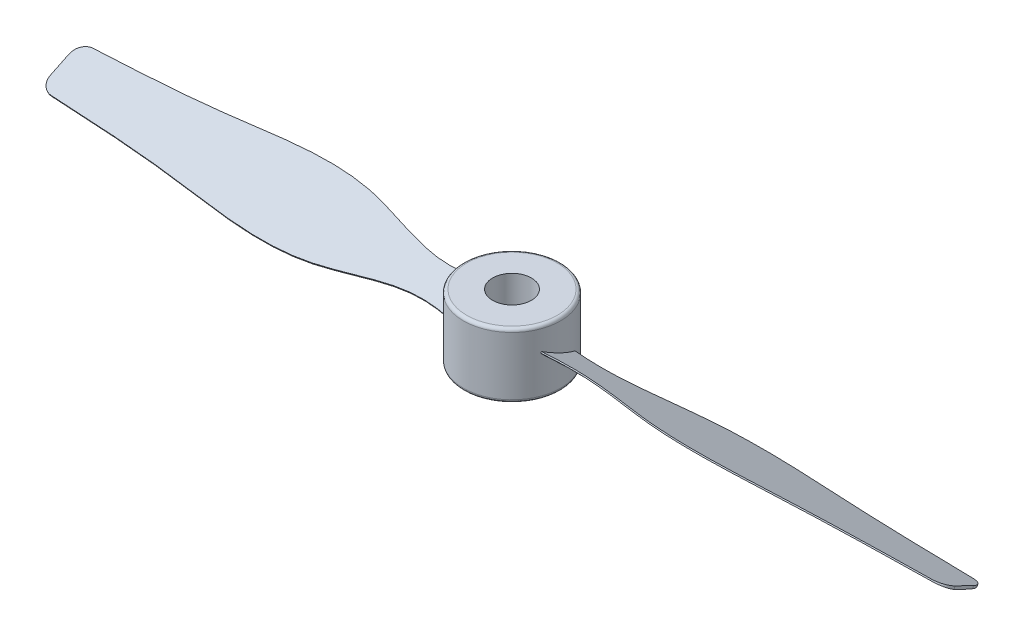
ISO-10303-21;
HEADER;
FILE_DESCRIPTION(('STEP AP214'),'2;1');
FILE_NAME('part.step','',(''),(''),'','','');
FILE_SCHEMA(('AUTOMOTIVE_DESIGN { 1 0 10303 214 1 1 1 1 }'));
ENDSEC;
DATA;
#1=APPLICATION_CONTEXT('core data for automotive mechanical design processes');
#2=APPLICATION_PROTOCOL_DEFINITION('international standard','automotive_design',2000,#1);
#3=PRODUCT_CONTEXT('',#1,'mechanical');
#4=PRODUCT('Part','Part','',(#3));
#5=PRODUCT_RELATED_PRODUCT_CATEGORY('part','',(#4));
#6=PRODUCT_DEFINITION_FORMATION('','',#4);
#7=PRODUCT_DEFINITION_CONTEXT('part definition',#1,'design');
#8=PRODUCT_DEFINITION('design','',#6,#7);
#9=PRODUCT_DEFINITION_SHAPE('','',#8);
#10=(LENGTH_UNIT() NAMED_UNIT(*) SI_UNIT(.MILLI.,.METRE.));
#11=(NAMED_UNIT(*) PLANE_ANGLE_UNIT() SI_UNIT($,.RADIAN.));
#12=(NAMED_UNIT(*) SI_UNIT($,.STERADIAN.) SOLID_ANGLE_UNIT());
#13=UNCERTAINTY_MEASURE_WITH_UNIT(LENGTH_MEASURE(1.E-05),#10,'distance_accuracy_value','');
#14=(GEOMETRIC_REPRESENTATION_CONTEXT(3) GLOBAL_UNCERTAINTY_ASSIGNED_CONTEXT((#13)) GLOBAL_UNIT_ASSIGNED_CONTEXT((#10,
#11,#12)) REPRESENTATION_CONTEXT('',''));
#15=CARTESIAN_POINT('',(0.,0.,0.));
#16=DIRECTION('',(0.,0.,1.));
#17=DIRECTION('',(1.,0.,0.));
#18=AXIS2_PLACEMENT_3D('',#15,#16,#17);
#19=CARTESIAN_POINT('',(0.,10.,0.));
#20=DIRECTION('',(0.,-1.,0.));
#21=DIRECTION('',(0.,0.,-1.));
#22=AXIS2_PLACEMENT_3D('',#19,#20,#21);
#23=CYLINDRICAL_SURFACE('',#22,7.5);
#24=CARTESIAN_POINT('',(0.,0.5,0.));
#25=DIRECTION('',(0.,1.,0.));
#26=DIRECTION('',(0.,0.,1.));
#27=AXIS2_PLACEMENT_3D('',#24,#25,#26);
#28=CIRCLE('',#27,7.5);
#29=CARTESIAN_POINT('',(0.,0.5,7.5));
#30=VERTEX_POINT('',#29);
#31=EDGE_CURVE('E450',#30,#30,#28,.T.);
#32=ORIENTED_EDGE('',*,*,#31,.T.);
#33=EDGE_LOOP('',(#32));
#34=FACE_BOUND('',#33,.T.);
#35=CARTESIAN_POINT('',(0.,9.5,0.));
#36=DIRECTION('',(0.,1.,0.));
#37=DIRECTION('',(0.,0.,1.));
#38=AXIS2_PLACEMENT_3D('',#35,#36,#37);
#39=CIRCLE('',#38,7.5);
#40=CARTESIAN_POINT('',(0.,9.5,7.5));
#41=VERTEX_POINT('',#40);
#42=EDGE_CURVE('E452',#41,#41,#39,.F.);
#43=ORIENTED_EDGE('',*,*,#42,.T.);
#44=EDGE_LOOP('',(#43));
#45=FACE_BOUND('',#44,.T.);
#46=CARTESIAN_POINT('',(7.06979787903294,6.43030076067993,2.50358901372038));
#47=CARTESIAN_POINT('',(7.06437746178913,6.40065388167233,2.5188965163108));
#48=CARTESIAN_POINT('',(7.05889862031606,6.3710207854884,2.53420954992158));
#49=CARTESIAN_POINT('',(7.04782408891142,6.31178215876791,2.56484667918385));
#50=CARTESIAN_POINT('',(7.04222839897984,6.28217662823135,2.58017077483534));
#51=CARTESIAN_POINT('',(7.036574284819,6.25258488051848,2.59550040150718));
#52=B_SPLINE_CURVE_WITH_KNOTS('',3,(#46,#47,#48,#49,#50,#51),.UNSPECIFIED.,.F.,.F.,(4,2,4),(0.,
0.101408302546085,0.202816605092171),.UNSPECIFIED.);
#53=CARTESIAN_POINT('',(7.06979787903294,6.43030076067993,2.50358901372038));
#54=VERTEX_POINT('',#53);
#55=CARTESIAN_POINT('',(7.03657428482255,6.2525848805371,2.59550040149754));
#56=VERTEX_POINT('',#55);
#57=EDGE_CURVE('E367',#54,#56,#52,.T.);
#58=ORIENTED_EDGE('',*,*,#57,.F.);
#59=CARTESIAN_POINT('',(0.,5.22207218793321,0.));
#60=DIRECTION('',(0.,-0.900608049397676,0.434632190892613));
#61=DIRECTION('',(0.,-0.434632190892614,-0.900608049397676));
#62=AXIS2_PLACEMENT_3D('',#59,#60,#61);
#63=ELLIPSE('',#62,8.32770704749528,7.5);
#64=CARTESIAN_POINT('',(7.49987406218174,5.20109689924882,-0.0434632183796787));
#65=VERTEX_POINT('',#64);
#66=EDGE_CURVE('E391',#65,#54,#63,.T.);
#67=ORIENTED_EDGE('',*,*,#66,.F.);
#68=CARTESIAN_POINT('',(7.49987406218174,5.02097528902684,0.0434632190892608));
#69=DIRECTION('',(0.,0.900608049397676,-0.434632190892614));
#70=VECTOR('',#69,1.);
#71=LINE('',#68,#70);
#72=CARTESIAN_POINT('',(7.49987406218174,5.02097528902684,0.0434632190892648));
#73=VERTEX_POINT('',#72);
#74=EDGE_CURVE('E601',#65,#73,#71,.F.);
#75=ORIENTED_EDGE('',*,*,#74,.T.);
#76=CARTESIAN_POINT('',(0.,5.,0.));
#77=DIRECTION('',(0.,-0.900608049397676,0.434632190892614));
#78=DIRECTION('',(0.,-0.434632190892614,-0.900608049397676));
#79=AXIS2_PLACEMENT_3D('',#76,#77,#78);
#80=ELLIPSE('',#79,8.32770704749528,7.5);
#81=CARTESIAN_POINT('',(7.03657428482256,3.74741511946291,-2.59550040149754));
#82=VERTEX_POINT('',#81);
#83=EDGE_CURVE('E552',#82,#73,#80,.T.);
#84=ORIENTED_EDGE('',*,*,#83,.F.);
#85=CARTESIAN_POINT('',(7.03657428482256,3.74741511946291,-2.59550040149754));
#86=CARTESIAN_POINT('',(7.07662905876549,3.76093746206632,-2.48693024530718));
#87=CARTESIAN_POINT('',(7.11408835111391,3.77621928159622,-2.37761597142014));
#88=CARTESIAN_POINT('',(7.1837788845091,3.81051952778591,-2.15790963326682));
#89=CARTESIAN_POINT('',(7.21600997018926,3.82953806545262,-2.04751753707421));
#90=CARTESIAN_POINT('',(7.27520399301563,3.87152818053347,-1.82607483594392));
#91=CARTESIAN_POINT('',(7.30216704128785,3.8944996745432,-1.71502424494771));
#92=CARTESIAN_POINT('',(7.35074091172692,3.94442048993412,-1.4931354672337));
#93=CARTESIAN_POINT('',(7.37237271355903,3.97135353070412,-1.38229820799379));
#94=CARTESIAN_POINT('',(7.4104734953373,4.02935041300608,-1.16082152262844));
#95=CARTESIAN_POINT('',(7.42694274541108,4.06041403828637,-1.05018208645332));
#96=CARTESIAN_POINT('',(7.45481357318441,4.12672654089465,-0.829533017913956));
#97=CARTESIAN_POINT('',(7.46621533304317,4.16197526772461,-0.719523363051548));
#98=CARTESIAN_POINT('',(7.48850992868821,4.25522083005756,-0.446297107920718));
#99=CARTESIAN_POINT('',(7.49635475476582,4.31583871223352,-0.283709407251972));
#100=CARTESIAN_POINT('',(7.50162842243936,4.44666749347483,0.0377406690701018));
#101=CARTESIAN_POINT('',(7.49905572178172,4.51687981145319,0.196602489627101));
#102=CARTESIAN_POINT('',(7.48432471955586,4.66703354794572,0.509308662821247));
#103=CARTESIAN_POINT('',(7.47216116663627,4.74698027613094,0.663150218604599));
#104=CARTESIAN_POINT('',(7.43928098302997,4.91660507625531,0.964391798605734));
#105=CARTESIAN_POINT('',(7.41856563990044,5.00628168176684,1.11179278882196));
#106=CARTESIAN_POINT('',(7.37302153390867,5.18283840081659,1.38005664239164));
#107=CARTESIAN_POINT('',(7.34909386344946,5.26853127339078,1.50185785930604));
#108=CARTESIAN_POINT('',(7.29659982675239,5.44704323813361,1.73907662518342));
#109=CARTESIAN_POINT('',(7.26803336584932,5.53986247571175,1.85449404380584));
#110=CARTESIAN_POINT('',(7.20720248124752,5.73231337014974,2.07838622001872));
#111=CARTESIAN_POINT('',(7.17493926726574,5.83194279417873,2.18686323076655));
#112=CARTESIAN_POINT('',(7.1076228475285,6.03758378786646,2.39663100761143));
#113=CARTESIAN_POINT('',(7.07257015549429,6.14359418150866,2.49792309044413));
#114=CARTESIAN_POINT('',(7.03657428482257,6.2525848805371,2.59550040149754));
#115=B_SPLINE_CURVE_WITH_KNOTS('',3,(#85,#86,#87,#88,#89,#90,#91,#92,#93,#94,#95,#96,#97,#98,
#99,#100,#101,#102,#103,#104,#105,#106,#107,#108,#109,#110,#111,#112,#113,#114),.UNSPECIFIED.,
.F.,.F.,(4,2,2,2,2,2,2,2,2,2,2,2,2,2,4),(0.,0.349495551491645,0.6990014870402,1.04850004918046,
1.39660046944836,1.74468267251622,2.0927523621889,2.61318664277018,3.13369797340283,
3.65449450158715,4.175212647248,4.62734951014627,5.07949560109898,5.53149415311062,
5.98340965507997),.UNSPECIFIED.);
#116=EDGE_CURVE('E356',#82,#56,#115,.T.);
#117=ORIENTED_EDGE('',*,*,#116,.T.);
#118=EDGE_LOOP('',(#58,#67,#75,#84,#117));
#119=FACE_BOUND('',#118,.T.);
#120=CARTESIAN_POINT('',(-7.06979787903294,6.43030076067993,-2.50358901372038));
#121=CARTESIAN_POINT('',(-7.06437746178913,6.40065388167233,-2.5188965163108));
#122=CARTESIAN_POINT('',(-7.05889862031606,6.3710207854884,-2.53420954992158));
#123=CARTESIAN_POINT('',(-7.04782408891142,6.31178215876791,-2.56484667918385));
#124=CARTESIAN_POINT('',(-7.04222839897984,6.28217662823135,-2.58017077483534));
#125=CARTESIAN_POINT('',(-7.036574284819,6.25258488051848,-2.59550040150718));
#126=B_SPLINE_CURVE_WITH_KNOTS('',3,(#120,#121,#122,#123,#124,#125),.UNSPECIFIED.,.F.,.F.,(4,2,
4),(0.,0.101408302546085,0.202816605092171),.UNSPECIFIED.);
#127=CARTESIAN_POINT('',(-7.06979787903294,6.43030076067993,-2.50358901372038));
#128=VERTEX_POINT('',#127);
#129=CARTESIAN_POINT('',(-7.03657428482255,6.2525848805371,-2.59550040149754));
#130=VERTEX_POINT('',#129);
#131=EDGE_CURVE('E302',#128,#130,#126,.T.);
#132=ORIENTED_EDGE('',*,*,#131,.F.);
#133=CARTESIAN_POINT('',(0.,5.22207218793321,0.));
#134=DIRECTION('',(0.,-0.900608049397676,-0.434632190892613));
#135=DIRECTION('',(0.,-0.434632190892614,0.900608049397676));
#136=AXIS2_PLACEMENT_3D('',#133,#134,#135);
#137=ELLIPSE('',#136,8.32770704749528,7.5);
#138=CARTESIAN_POINT('',(-7.49987406218174,5.20109689924882,0.0434632183796787));
#139=VERTEX_POINT('',#138);
#140=EDGE_CURVE('E390',#139,#128,#137,.T.);
#141=ORIENTED_EDGE('',*,*,#140,.F.);
#142=CARTESIAN_POINT('',(-7.49987406218174,5.20109689890637,0.0434632190892623));
#143=CARTESIAN_POINT('',(-7.49994528928224,5.14422940763765,0.03117240682583));
#144=CARTESIAN_POINT('',(-7.49998630325902,5.08736190459017,0.0188815920130506));
#145=CARTESIAN_POINT('',(-7.49999903471289,5.02032959355229,0.00439384984873389));
#146=CARTESIAN_POINT('',(-7.50000000000886,5.01016479696431,0.0021969249650925));
#147=CARTESIAN_POINT('',(-7.5,5.,0.));
#148=B_SPLINE_CURVE_WITH_KNOTS('',3,(#142,#143,#144,#145,#146,#147),.UNSPECIFIED.,.F.,.F.,(4,2,
4),(0.,0.174541709696757,0.205740205268831),.UNSPECIFIED.);
#149=CARTESIAN_POINT('',(-7.5,5.,0.));
#150=VERTEX_POINT('',#149);
#151=EDGE_CURVE('E306',#150,#139,#148,.F.);
#152=ORIENTED_EDGE('',*,*,#151,.F.);
#153=CARTESIAN_POINT('',(0.,5.,0.));
#154=DIRECTION('',(0.,-0.900608049397676,-0.434632190892614));
#155=DIRECTION('',(0.,-0.434632190892614,0.900608049397676));
#156=AXIS2_PLACEMENT_3D('',#153,#154,#155);
#157=ELLIPSE('',#156,8.32770704749528,7.5);
#158=CARTESIAN_POINT('',(-7.03657428482256,3.74741511946291,2.59550040149754));
#159=VERTEX_POINT('',#158);
#160=EDGE_CURVE('E315',#159,#150,#157,.T.);
#161=ORIENTED_EDGE('',*,*,#160,.F.);
#162=CARTESIAN_POINT('',(-7.03657428482256,3.74741511946291,2.59550040149754));
#163=CARTESIAN_POINT('',(-7.07662905876549,3.76093746206632,2.48693024530718));
#164=CARTESIAN_POINT('',(-7.11408835111391,3.77621928159622,2.37761597142014));
#165=CARTESIAN_POINT('',(-7.1837788845091,3.81051952778591,2.15790963326682));
#166=CARTESIAN_POINT('',(-7.21600997018926,3.82953806545262,2.04751753707421));
#167=CARTESIAN_POINT('',(-7.27520399301563,3.87152818053347,1.82607483594392));
#168=CARTESIAN_POINT('',(-7.30216704128785,3.8944996745432,1.71502424494771));
#169=CARTESIAN_POINT('',(-7.35074091172692,3.94442048993412,1.4931354672337));
#170=CARTESIAN_POINT('',(-7.37237271355903,3.97135353070412,1.38229820799379));
#171=CARTESIAN_POINT('',(-7.4104734953373,4.02935041300608,1.16082152262844));
#172=CARTESIAN_POINT('',(-7.42694274541108,4.06041403828637,1.05018208645332));
#173=CARTESIAN_POINT('',(-7.45481357318441,4.12672654089465,0.829533017913956));
#174=CARTESIAN_POINT('',(-7.46621533304317,4.16197526772461,0.719523363051548));
#175=CARTESIAN_POINT('',(-7.48850992868821,4.25522083005756,0.446297107920718));
#176=CARTESIAN_POINT('',(-7.49635475476582,4.31583871223352,0.283709407251972));
#177=CARTESIAN_POINT('',(-7.50162842243936,4.44666749347483,-0.0377406690701018));
#178=CARTESIAN_POINT('',(-7.49905572178172,4.51687981145319,-0.196602489627101));
#179=CARTESIAN_POINT('',(-7.48432471955586,4.66703354794572,-0.509308662821247));
#180=CARTESIAN_POINT('',(-7.47216116663627,4.74698027613094,-0.663150218604599));
#181=CARTESIAN_POINT('',(-7.43928098302997,4.91660507625531,-0.964391798605734));
#182=CARTESIAN_POINT('',(-7.41856563990044,5.00628168176684,-1.11179278882196));
#183=CARTESIAN_POINT('',(-7.37302153390867,5.18283840081659,-1.38005664239164));
#184=CARTESIAN_POINT('',(-7.34909386344946,5.26853127339078,-1.50185785930604));
#185=CARTESIAN_POINT('',(-7.29659982675239,5.44704323813361,-1.73907662518342));
#186=CARTESIAN_POINT('',(-7.26803336584932,5.53986247571175,-1.85449404380584));
#187=CARTESIAN_POINT('',(-7.20720248124752,5.73231337014974,-2.07838622001872));
#188=CARTESIAN_POINT('',(-7.17493926726574,5.83194279417873,-2.18686323076655));
#189=CARTESIAN_POINT('',(-7.1076228475285,6.03758378786646,-2.39663100761143));
#190=CARTESIAN_POINT('',(-7.07257015549429,6.14359418150866,-2.49792309044413));
#191=CARTESIAN_POINT('',(-7.03657428482257,6.2525848805371,-2.59550040149754));
#192=B_SPLINE_CURVE_WITH_KNOTS('',3,(#162,#163,#164,#165,#166,#167,#168,#169,#170,#171,#172,
#173,#174,#175,#176,#177,#178,#179,#180,#181,#182,#183,#184,#185,#186,#187,#188,#189,#190,#191),
.UNSPECIFIED.,.F.,.F.,(4,2,2,2,2,2,2,2,2,2,2,2,2,2,4),(0.,0.349495551491645,0.6990014870402,
1.04850004918046,1.39660046944836,1.74468267251622,2.0927523621889,2.61318664277018,
3.13369797340283,3.65449450158715,4.175212647248,4.62734951014627,5.07949560109898,
5.53149415311062,5.98340965507997),.UNSPECIFIED.);
#193=EDGE_CURVE('E381',#159,#130,#192,.T.);
#194=ORIENTED_EDGE('',*,*,#193,.T.);
#195=EDGE_LOOP('',(#132,#141,#152,#161,#194));
#196=FACE_BOUND('',#195,.T.);
#197=ADVANCED_FACE('F171',(#34,#45,#119,#196),#23,.T.);
#198=CARTESIAN_POINT('',(0.,10.,0.));
#199=DIRECTION('',(0.,1.,0.));
#200=DIRECTION('',(0.,0.,1.));
#201=AXIS2_PLACEMENT_3D('',#198,#199,#200);
#202=PLANE('',#201);
#203=CARTESIAN_POINT('',(0.,10.,0.));
#204=DIRECTION('',(0.,1.,0.));
#205=DIRECTION('',(0.,0.,1.));
#206=AXIS2_PLACEMENT_3D('',#203,#204,#205);
#207=CIRCLE('',#206,7.);
#208=CARTESIAN_POINT('',(0.,10.,7.));
#209=VERTEX_POINT('',#208);
#210=EDGE_CURVE('E12',#209,#209,#207,.T.);
#211=ORIENTED_EDGE('',*,*,#210,.T.);
#212=EDGE_LOOP('',(#211));
#213=FACE_BOUND('',#212,.T.);
#214=CARTESIAN_POINT('',(0.,10.,0.));
#215=DIRECTION('',(0.,1.,0.));
#216=DIRECTION('',(0.,0.,1.));
#217=AXIS2_PLACEMENT_3D('',#214,#215,#216);
#218=CIRCLE('',#217,3.);
#219=CARTESIAN_POINT('',(0.,10.,3.));
#220=VERTEX_POINT('',#219);
#221=EDGE_CURVE('E660',#220,#220,#218,.T.);
#222=ORIENTED_EDGE('',*,*,#221,.F.);
#223=EDGE_LOOP('',(#222));
#224=FACE_BOUND('',#223,.T.);
#225=ADVANCED_FACE('F346',(#213,#224),#202,.T.);
#226=CARTESIAN_POINT('',(0.,0.,0.));
#227=DIRECTION('',(0.,1.,0.));
#228=DIRECTION('',(0.,0.,1.));
#229=AXIS2_PLACEMENT_3D('',#226,#227,#228);
#230=PLANE('',#229);
#231=CARTESIAN_POINT('',(0.,0.,0.));
#232=DIRECTION('',(0.,1.,0.));
#233=DIRECTION('',(0.,0.,1.));
#234=AXIS2_PLACEMENT_3D('',#231,#232,#233);
#235=CIRCLE('',#234,7.);
#236=CARTESIAN_POINT('',(0.,0.,7.));
#237=VERTEX_POINT('',#236);
#238=EDGE_CURVE('E180',#237,#237,#235,.F.);
#239=ORIENTED_EDGE('',*,*,#238,.T.);
#240=EDGE_LOOP('',(#239));
#241=FACE_BOUND('',#240,.T.);
#242=CARTESIAN_POINT('',(0.,0.,0.));
#243=DIRECTION('',(0.,1.,0.));
#244=DIRECTION('',(0.,0.,1.));
#245=AXIS2_PLACEMENT_3D('',#242,#243,#244);
#246=CIRCLE('',#245,3.);
#247=CARTESIAN_POINT('',(0.,0.,3.));
#248=VERTEX_POINT('',#247);
#249=EDGE_CURVE('E667',#248,#248,#246,.T.);
#250=ORIENTED_EDGE('',*,*,#249,.T.);
#251=EDGE_LOOP('',(#250));
#252=FACE_BOUND('',#251,.T.);
#253=ADVANCED_FACE('F348',(#241,#252),#230,.F.);
#254=CARTESIAN_POINT('',(69.8,3.47878733187585,-3.15212817289187));
#255=CARTESIAN_POINT('',(62.5395563128578,3.35928622722067,-3.39974825032641));
#256=CARTESIAN_POINT('',(47.955671430176,3.11924712923402,-3.89713695817375));
#257=CARTESIAN_POINT('',(28.9148169987277,1.83903246168579,-6.54988946641071));
#258=CARTESIAN_POINT('',(13.0312032489261,4.52447028863247,-0.985352430766383));
#259=CARTESIAN_POINT('',(4.33886564646154,3.53704044231573,-3.0314210065477));
#260=CARTESIAN_POINT('',(0.,3.04415514098324,-4.05273622228954));
#261=CARTESIAN_POINT('',(69.8,4.04397010830119,-1.38852954050064));
#262=CARTESIAN_POINT('',(62.5395563128578,3.93607568500504,-1.34620821791078));
#263=CARTESIAN_POINT('',(47.955671430176,3.71935065873412,-1.26119835855104));
#264=CARTESIAN_POINT('',(28.9148169987277,2.46597699231558,-3.10309342658199));
#265=CARTESIAN_POINT('',(13.0312032489261,4.36092874798643,-0.684881670681051));
#266=CARTESIAN_POINT('',(4.33886564646154,3.80582267312915,-1.006343469233));
#267=CARTESIAN_POINT('',(0.,3.52873602641889,-1.16680428175267));
#268=CARTESIAN_POINT('',(69.8,5.22807759822828,1.40481135694913));
#269=CARTESIAN_POINT('',(62.5395563128578,5.02578705316163,1.40217643648697));
#270=CARTESIAN_POINT('',(47.955671430176,4.61945072590224,1.39688373285189));
#271=CARTESIAN_POINT('',(28.9148169987277,5.65791825656368,3.71565990737908));
#272=CARTESIAN_POINT('',(13.0312032489261,4.78912877354933,0.873765705755611));
#273=CARTESIAN_POINT('',(4.33886564646154,4.55350358863067,1.22992495080293));
#274=CARTESIAN_POINT('',(0.,4.43588896445928,1.40770533436365));
#275=CARTESIAN_POINT('',(69.8,6.52121266812416,3.15212817289188));
#276=CARTESIAN_POINT('',(62.5395563128578,6.64071377277934,3.39974825032641));
#277=CARTESIAN_POINT('',(47.955671430176,6.88075287076599,3.89713695817375));
#278=CARTESIAN_POINT('',(28.9148169987277,8.16096753831422,6.54988946641071));
#279=CARTESIAN_POINT('',(13.0312032489261,5.47552971136754,0.985352430766382));
#280=CARTESIAN_POINT('',(4.33886564646154,6.46295955768428,3.0314210065477));
#281=CARTESIAN_POINT('',(0.,6.95584485901677,4.05273622228954));
#282=B_SPLINE_SURFACE_WITH_KNOTS('',3,3,((#254,#255,#256,#257,#258,#259,#260),(#261,#262,#263,
#264,#265,#266,#267),(#268,#269,#270,#271,#272,#273,#274),(#275,#276,#277,#278,#279,#280,#281)),
.UNSPECIFIED.,.F.,.F.,.F.,(4,4),(4,1,1,1,4),(0.,1.),(0.,0.311774030948101,0.626253266698981,
0.813440649022051,1.),.UNSPECIFIED.);
#283=CARTESIAN_POINT('',(69.8,3.47878733187585,-3.15212817289187));
#284=CARTESIAN_POINT('',(62.5395563128578,3.35928622722067,-3.3997482503264));
#285=CARTESIAN_POINT('',(47.955671430176,3.11924712923402,-3.89713695817374));
#286=CARTESIAN_POINT('',(28.9148169987277,1.83903246168579,-6.54988946641071));
#287=CARTESIAN_POINT('',(13.0312032489261,4.52447028863247,-0.985352430766383));
#288=CARTESIAN_POINT('',(4.33886564646154,3.53704044231573,-3.0314210065477));
#289=CARTESIAN_POINT('',(0.,3.04415514098324,-4.05273622228954));
#290=B_SPLINE_CURVE_WITH_KNOTS('',3,(#283,#284,#285,#286,#287,#288,#289),.UNSPECIFIED.,.F.,.F.,
(4,1,1,1,4),(0.,0.311774030948101,0.626253266698981,0.813440649022051,1.),.UNSPECIFIED.);
#291=CARTESIAN_POINT('',(67.8765939984037,3.44700257720184,-3.21798985204812));
#292=VERTEX_POINT('',#291);
#293=EDGE_CURVE('E603',#292,#82,#290,.T.);
#294=CARTESIAN_POINT('',(67.8765939984037,3.44700257720184,-3.21798985204812));
#295=CARTESIAN_POINT('',(67.9324896540519,3.44793498357098,-3.21606118997028));
#296=CARTESIAN_POINT('',(67.9882681901204,3.44956351747522,-3.21186427207019));
#297=CARTESIAN_POINT('',(68.0992406282063,3.45422154526724,-3.1989833060749));
#298=CARTESIAN_POINT('',(68.1544345817718,3.45725091456,-3.19029965703662));
#299=CARTESIAN_POINT('',(68.3184082485678,3.46843870243581,-3.15763551968384));
#300=CARTESIAN_POINT('',(68.4258079681982,3.47870050142089,-3.12703363167988));
#301=CARTESIAN_POINT('',(68.6336504848996,3.50482255889416,-3.04921499835277));
#302=CARTESIAN_POINT('',(68.7340912513343,3.52068444333643,-3.0019934276084));
#303=CARTESIAN_POINT('',(68.9252671980906,3.55791261780775,-2.89247440831619));
#304=CARTESIAN_POINT('',(69.0160029542474,3.57927858100222,-2.83017785494065));
#305=CARTESIAN_POINT('',(69.1858154776876,3.62742597191113,-2.69200169524371));
#306=CARTESIAN_POINT('',(69.2648146888937,3.65424087120204,-2.61603848549275));
#307=CARTESIAN_POINT('',(69.4083069407388,3.71276955153802,-2.45305522451624));
#308=CARTESIAN_POINT('',(69.4727959766179,3.74448468096645,-2.36603213114486));
#309=CARTESIAN_POINT('',(69.5858086862996,3.81236175738691,-2.18290873130502));
#310=CARTESIAN_POINT('',(69.634227830888,3.84855079501621,-2.08675403298326));
#311=CARTESIAN_POINT('',(69.7131202201102,3.92431984579909,-1.88864643979565));
#312=CARTESIAN_POINT('',(69.7436087752437,3.96389693279776,-1.78669857339725));
#313=CARTESIAN_POINT('',(69.7764448198428,4.02726555237835,-1.62585146427801));
#314=CARTESIAN_POINT('',(69.7852756305089,4.05028007341496,-1.56789632342778));
#315=CARTESIAN_POINT('',(69.7970493191213,4.09678082716749,-1.45169108661257));
#316=CARTESIAN_POINT('',(69.8000019250232,4.12026621545109,-1.39344163817167));
#317=CARTESIAN_POINT('',(69.8,4.14391226801493,-1.3352247390315));
#318=B_SPLINE_CURVE_WITH_KNOTS('',3,(#294,#295,#296,#297,#298,#299,#300,#301,#302,#303,#304,
#305,#306,#307,#308,#309,#310,#311,#312,#313,#314,#315,#316,#317),.UNSPECIFIED.,.F.,.F.,(4,2,2,
2,2,2,2,2,2,2,2,4),(0.,0.167705854306468,0.335396795157617,0.67010233473927,1.00490513426468,
1.33968805763563,1.67659326715943,2.01359134764423,2.35274038352718,2.69159940614967,
2.88029032063335,3.06866870640483),.UNSPECIFIED.);
#319=CARTESIAN_POINT('',(69.8,4.14391226801515,-1.33522473903096));
#320=VERTEX_POINT('',#319);
#321=EDGE_CURVE('E476',#292,#320,#318,.T.);
#322=CARTESIAN_POINT('',(69.8,3.47878733187585,-3.15212817289187));
#323=CARTESIAN_POINT('',(69.8,4.04397010830119,-1.38852954050064));
#324=CARTESIAN_POINT('',(69.8,5.22807759822828,1.40481135694913));
#325=CARTESIAN_POINT('',(69.8,6.52121266812416,3.15212817289188));
#326=B_SPLINE_CURVE_WITH_KNOTS('',3,(#322,#323,#324,#325),.UNSPECIFIED.,.F.,.F.,(4,4),(0.,1.),.UNSPECIFIED.);
#327=CARTESIAN_POINT('',(69.8,5.4877955630298,1.51296202706403));
#328=VERTEX_POINT('',#327);
#329=EDGE_CURVE('E609',#320,#328,#326,.T.);
#330=CARTESIAN_POINT('',(69.8,5.48779556307373,1.51296202703981));
#331=CARTESIAN_POINT('',(69.7999997796045,5.5150502198756,1.56239512777162));
#332=CARTESIAN_POINT('',(69.7976157117628,5.54246850997834,1.61170672855178));
#333=CARTESIAN_POINT('',(69.788111216619,5.59747664517556,1.70976981558204));
#334=CARTESIAN_POINT('',(69.7809911408201,5.62506647738777,1.75852134312725));
#335=CARTESIAN_POINT('',(69.752609251562,5.70776131012466,1.90328817364191));
#336=CARTESIAN_POINT('',(69.7243255055871,5.76289606103103,1.99800536232768));
#337=CARTESIAN_POINT('',(69.6498743685221,5.87158389731639,2.18108024635899));
#338=CARTESIAN_POINT('',(69.6037005987898,5.92513641121487,2.26943566009055));
#339=CARTESIAN_POINT('',(69.4948130140507,6.02901727680239,2.43742044686097));
#340=CARTESIAN_POINT('',(69.4321006906366,6.07934591874013,2.51705060590402));
#341=CARTESIAN_POINT('',(69.2916089272687,6.17523157679484,2.66585904161925));
#342=CARTESIAN_POINT('',(69.2137686330937,6.22076813575077,2.73499302531056));
#343=CARTESIAN_POINT('',(69.0453069241388,6.30503572746561,2.86077698127332));
#344=CARTESIAN_POINT('',(68.9546816699834,6.34376470800541,2.91742319027186));
#345=CARTESIAN_POINT('',(68.7630463554034,6.4126713571705,3.01697693911411));
#346=CARTESIAN_POINT('',(68.6620225639839,6.44283751620086,3.05986599744636));
#347=CARTESIAN_POINT('',(68.4525648397029,6.49293736349073,3.13081541939857));
#348=CARTESIAN_POINT('',(68.3441390909015,6.51288215195416,3.15889187019463));
#349=CARTESIAN_POINT('',(68.1749693263152,6.53471479246376,3.19008831835556));
#350=CARTESIAN_POINT('',(68.1156947265124,6.54068447857681,3.19873760696487));
#351=CARTESIAN_POINT('',(67.9965222614512,6.54932564353505,3.21164887056062));
#352=CARTESIAN_POINT('',(67.9366254646361,6.55200205698523,3.21591740802171));
#353=CARTESIAN_POINT('',(67.8765939984037,6.55299742279817,3.21798985204813));
#354=B_SPLINE_CURVE_WITH_KNOTS('',3,(#330,#331,#332,#333,#334,#335,#336,#337,#338,#339,#340,
#341,#342,#343,#344,#345,#346,#347,#348,#349,#350,#351,#352,#353),.UNSPECIFIED.,.F.,.F.,(4,2,2,
2,2,2,2,2,2,2,2,4),(0.,0.16924100697119,0.338469454389224,0.676285206743009,1.01422151744296,
1.35212736048112,1.69142171126492,2.03081817127882,2.37066868906267,2.71014934971166,
2.89052228700266,3.07062462497349),.UNSPECIFIED.);
#355=CARTESIAN_POINT('',(67.8765939984037,6.55299742279817,3.21798985204812));
#356=VERTEX_POINT('',#355);
#357=EDGE_CURVE('E483',#328,#356,#354,.T.);
#358=CARTESIAN_POINT('',(69.8,6.52121266812415,3.15212817289187));
#359=CARTESIAN_POINT('',(62.5395563128578,6.64071377277933,3.3997482503264));
#360=CARTESIAN_POINT('',(47.955671430176,6.88075287076599,3.89713695817374));
#361=CARTESIAN_POINT('',(28.9148169987277,8.16096753831421,6.5498894664107));
#362=CARTESIAN_POINT('',(13.0312032489261,5.47552971136754,0.985352430766383));
#363=CARTESIAN_POINT('',(4.33886564646154,6.46295955768427,3.0314210065477));
#364=CARTESIAN_POINT('',(0.,6.95584485901676,4.05273622228954));
#365=B_SPLINE_CURVE_WITH_KNOTS('',3,(#358,#359,#360,#361,#362,#363,#364),.UNSPECIFIED.,.F.,.F.,
(4,1,1,1,4),(0.,0.311774030948101,0.626253266698981,0.813440649022051,1.),.UNSPECIFIED.);
#366=EDGE_CURVE('E606',#356,#56,#365,.T.);
#367=ORIENTED_EDGE('',*,*,#293,.F.);
#368=ORIENTED_EDGE('',*,*,#321,.T.);
#369=ORIENTED_EDGE('',*,*,#329,.T.);
#370=ORIENTED_EDGE('',*,*,#357,.T.);
#371=ORIENTED_EDGE('',*,*,#366,.T.);
#372=ORIENTED_EDGE('',*,*,#116,.F.);
#373=EDGE_LOOP('',(#367,#368,#369,#370,#371,#372));
#374=FACE_BOUND('',#373,.T.);
#375=ADVANCED_FACE('F489',(#374),#282,.T.);
#376=CARTESIAN_POINT('',(69.8,4.72701788994856,0.00610568116818735));
#377=DIRECTION('',(1.,0.,0.));
#378=DIRECTION('',(0.,0.,-1.));
#379=AXIS2_PLACEMENT_3D('',#376,#377,#378);
#380=PLANE('',#379);
#381=ORIENTED_EDGE('',*,*,#329,.F.);
#382=DIRECTION('',(0.,0.900608049397676,-0.434632190892614));
#383=VECTOR('',#382,1.);
#384=CARTESIAN_POINT('',(69.8,4.49575087724822,-1.50502156204437));
#385=LINE('',#384,#383);
#386=CARTESIAN_POINT('',(69.8,4.49575087724822,-1.50502156204437));
#387=VERTEX_POINT('',#386);
#388=EDGE_CURVE('E195',#320,#387,#385,.T.);
#389=ORIENTED_EDGE('',*,*,#388,.T.);
#390=DIRECTION('',(0.,-0.434632190892614,-0.900608049397676));
#391=VECTOR('',#390,1.);
#392=CARTESIAN_POINT('',(69.8,6.70133427800368,3.06520173471334));
#393=LINE('',#392,#391);
#394=CARTESIAN_POINT('',(69.8,5.86449234251085,1.33116868568733));
#395=VERTEX_POINT('',#394);
#396=EDGE_CURVE('E513',#395,#387,#393,.T.);
#397=ORIENTED_EDGE('',*,*,#396,.F.);
#398=DIRECTION('',(0.,0.900608049397676,-0.434632190892614));
#399=VECTOR('',#398,1.);
#400=CARTESIAN_POINT('',(69.8,5.68437073263132,1.41809512386585));
#401=LINE('',#400,#399);
#402=EDGE_CURVE('E472',#395,#328,#401,.F.);
#403=ORIENTED_EDGE('',*,*,#402,.T.);
#404=EDGE_LOOP('',(#381,#389,#397,#403));
#405=FACE_BOUND('',#404,.T.);
#406=ADVANCED_FACE('F546',(#405),#380,.T.);
#407=CARTESIAN_POINT('',(7.036574284819,6.43270649041689,2.50857396331955));
#408=CARTESIAN_POINT('',(9.02681129879157,6.28820632681401,2.20915295123858));
#409=CARTESIAN_POINT('',(15.3596219480797,6.04931637443783,1.71414540568986));
#410=CARTESIAN_POINT('',(28.9148169987277,8.34108914819375,6.46296302823218));
#411=CARTESIAN_POINT('',(47.955671430176,7.06087448064552,3.81021051999522));
#412=CARTESIAN_POINT('',(62.5395563128578,6.82083538265887,3.31282181214788));
#413=CARTESIAN_POINT('',(69.8,6.70133427800368,3.06520173471334));
#414=B_SPLINE_CURVE_WITH_KNOTS('',3,(#407,#408,#409,#410,#411,#412,#413),.UNSPECIFIED.,.F.,.F.,
(4,1,1,1,4),(0.,0.0856705834200264,0.272857965743097,0.587337201493977,0.899111232442077),.UNSPECIFIED.);
#415=DIRECTION('',(0.,-0.900608049397676,0.434632190892614));
#416=VECTOR('',#415,1.);
#417=SURFACE_OF_LINEAR_EXTRUSION('',#414,#416);
#418=ORIENTED_EDGE('',*,*,#366,.F.);
#419=DIRECTION('',(0.,-0.900608049397676,0.434632190892614));
#420=VECTOR('',#419,1.);
#421=CARTESIAN_POINT('',(67.8765939984037,6.55299742279816,3.21798985204812));
#422=LINE('',#421,#420);
#423=CARTESIAN_POINT('',(67.8765939984036,6.7331190326777,3.1310634138696));
#424=VERTEX_POINT('',#423);
#425=EDGE_CURVE('E187',#356,#424,#422,.F.);
#426=ORIENTED_EDGE('',*,*,#425,.T.);
#427=EDGE_CURVE('E526',#54,#424,#414,.T.);
#428=ORIENTED_EDGE('',*,*,#427,.F.);
#429=ORIENTED_EDGE('',*,*,#57,.T.);
#430=EDGE_LOOP('',(#418,#426,#428,#429));
#431=FACE_BOUND('',#430,.T.);
#432=ADVANCED_FACE('F542',(#431),#417,.F.);
#433=CARTESIAN_POINT('',(69.8,3.65890894175539,-3.23905461107039));
#434=CARTESIAN_POINT('',(62.5395563128578,3.53940783710021,-3.48667468850493));
#435=CARTESIAN_POINT('',(47.955671430176,3.29936873911355,-3.98406339635227));
#436=CARTESIAN_POINT('',(28.9148169987277,2.01915407156532,-6.63681590458923));
#437=CARTESIAN_POINT('',(15.3596219480797,4.31092684532124,-1.88799828204691));
#438=CARTESIAN_POINT('',(9.02681129879158,4.07203689294506,-2.38300582759563));
#439=CARTESIAN_POINT('',(7.03657428481901,3.92753672934219,-2.68242683967659));
#440=B_SPLINE_CURVE_WITH_KNOTS('',3,(#433,#434,#435,#436,#437,#438,#439),.UNSPECIFIED.,.F.,.F.,
(4,1,1,1,4),(0.,0.311774030948101,0.626253266698981,0.813440649022051,0.899111232442077),.UNSPECIFIED.);
#441=DIRECTION('',(0.,-0.900608049397676,0.434632190892614));
#442=VECTOR('',#441,1.);
#443=SURFACE_OF_LINEAR_EXTRUSION('',#440,#442);
#444=CARTESIAN_POINT('',(67.8765939984036,3.62712418708137,-3.30491629022664));
#445=VERTEX_POINT('',#444);
#446=CARTESIAN_POINT('',(7.03657428481901,3.92753672934219,-2.68242683967659));
#447=VERTEX_POINT('',#446);
#448=EDGE_CURVE('E511',#445,#447,#440,.T.);
#449=ORIENTED_EDGE('',*,*,#448,.F.);
#450=DIRECTION('',(0.,-0.900608049397676,0.434632190892614));
#451=VECTOR('',#450,1.);
#452=CARTESIAN_POINT('',(67.8765939984036,3.62712418708137,-3.30491629022664));
#453=LINE('',#452,#451);
#454=EDGE_CURVE('E507',#445,#292,#453,.T.);
#455=ORIENTED_EDGE('',*,*,#454,.T.);
#456=ORIENTED_EDGE('',*,*,#293,.T.);
#457=DIRECTION('',(0.,-0.900608049397676,0.434632190892614));
#458=VECTOR('',#457,1.);
#459=CARTESIAN_POINT('',(7.03657428481901,3.92753672934219,-2.68242683967659));
#460=LINE('',#459,#458);
#461=EDGE_CURVE('E518',#447,#82,#460,.T.);
#462=ORIENTED_EDGE('',*,*,#461,.F.);
#463=EDGE_LOOP('',(#449,#455,#456,#462));
#464=FACE_BOUND('',#463,.T.);
#465=ADVANCED_FACE('F515',(#464),#443,.F.);
#466=CARTESIAN_POINT('',(0.,5.18012160987954,-0.0869264381785232));
#467=DIRECTION('',(0.,-0.900608049397676,0.434632190892614));
#468=DIRECTION('',(0.,-0.434632190892614,-0.900608049397676));
#469=AXIS2_PLACEMENT_3D('',#466,#467,#468);
#470=ELLIPSE('',#469,8.32770704749528,7.5);
#471=DIRECTION('',(0.,-0.900608049397676,0.434632190892614));
#472=VECTOR('',#471,1.);
#473=SURFACE_OF_LINEAR_EXTRUSION('',#470,#472);
#474=ORIENTED_EDGE('',*,*,#74,.F.);
#475=EDGE_CURVE('E521',#447,#65,#470,.T.);
#476=ORIENTED_EDGE('',*,*,#475,.F.);
#477=ORIENTED_EDGE('',*,*,#461,.T.);
#478=ORIENTED_EDGE('',*,*,#83,.T.);
#479=EDGE_LOOP('',(#474,#476,#477,#478));
#480=FACE_BOUND('',#479,.T.);
#481=ADVANCED_FACE('F541',(#480),#473,.F.);
#482=CARTESIAN_POINT('',(38.3455845692956,7.64971475166913,5.03035550466434));
#483=DIRECTION('',(0.,-0.900608049397676,0.434632190892613));
#484=DIRECTION('',(0.,-0.434632190892613,-0.900608049397676));
#485=AXIS2_PLACEMENT_3D('',#482,#483,#484);
#486=PLANE('',#485);
#487=ORIENTED_EDGE('',*,*,#396,.T.);
#488=CARTESIAN_POINT('',(67.8,4.49575087724822,-1.50502156204437));
#489=DIRECTION('',(0.,-0.900608049397676,0.434632190892613));
#490=DIRECTION('',(0.,-0.434632190892613,-0.900608049397676));
#491=AXIS2_PLACEMENT_3D('',#488,#489,#490);
#492=CIRCLE('',#491,2.);
#493=EDGE_CURVE('E464',#387,#445,#492,.F.);
#494=ORIENTED_EDGE('',*,*,#493,.T.);
#495=ORIENTED_EDGE('',*,*,#448,.T.);
#496=ORIENTED_EDGE('',*,*,#475,.T.);
#497=ORIENTED_EDGE('',*,*,#66,.T.);
#498=ORIENTED_EDGE('',*,*,#427,.T.);
#499=CARTESIAN_POINT('',(67.8,5.86449234251085,1.33116868568733));
#500=DIRECTION('',(0.,-0.900608049397676,0.434632190892613));
#501=DIRECTION('',(0.,-0.434632190892613,-0.900608049397676));
#502=AXIS2_PLACEMENT_3D('',#499,#500,#501);
#503=CIRCLE('',#502,2.);
#504=EDGE_CURVE('E467',#424,#395,#503,.F.);
#505=ORIENTED_EDGE('',*,*,#504,.T.);
#506=EDGE_LOOP('',(#487,#494,#495,#496,#497,#498,#505));
#507=FACE_BOUND('',#506,.T.);
#508=ADVANCED_FACE('F399',(#507),#486,.F.);
#509=CARTESIAN_POINT('',(-69.8,3.47878733187585,3.15212817289187));
#510=CARTESIAN_POINT('',(-62.5395563128578,3.35928622722067,3.39974825032641));
#511=CARTESIAN_POINT('',(-47.955671430176,3.11924712923402,3.89713695817375));
#512=CARTESIAN_POINT('',(-28.9148169987277,1.83903246168579,6.54988946641071));
#513=CARTESIAN_POINT('',(-13.0312032489261,4.52447028863247,0.985352430766383));
#514=CARTESIAN_POINT('',(-4.33886564646154,3.53704044231573,3.0314210065477));
#515=CARTESIAN_POINT('',(0.,3.04415514098324,4.05273622228954));
#516=CARTESIAN_POINT('',(-69.8,4.04397010830119,1.38852954050064));
#517=CARTESIAN_POINT('',(-62.5395563128578,3.93607568500504,1.34620821791078));
#518=CARTESIAN_POINT('',(-47.955671430176,3.71935065873412,1.26119835855104));
#519=CARTESIAN_POINT('',(-28.9148169987277,2.46597699231558,3.10309342658199));
#520=CARTESIAN_POINT('',(-13.0312032489261,4.36092874798643,0.684881670681051));
#521=CARTESIAN_POINT('',(-4.33886564646154,3.80582267312915,1.006343469233));
#522=CARTESIAN_POINT('',(0.,3.52873602641889,1.16680428175267));
#523=CARTESIAN_POINT('',(-69.8,5.22807759822828,-1.40481135694913));
#524=CARTESIAN_POINT('',(-62.5395563128578,5.02578705316163,-1.40217643648697));
#525=CARTESIAN_POINT('',(-47.955671430176,4.61945072590224,-1.39688373285189));
#526=CARTESIAN_POINT('',(-28.9148169987277,5.65791825656368,-3.71565990737908));
#527=CARTESIAN_POINT('',(-13.0312032489261,4.78912877354933,-0.873765705755611));
#528=CARTESIAN_POINT('',(-4.33886564646154,4.55350358863067,-1.22992495080293));
#529=CARTESIAN_POINT('',(0.,4.43588896445928,-1.40770533436365));
#530=CARTESIAN_POINT('',(-69.8,6.52121266812416,-3.15212817289188));
#531=CARTESIAN_POINT('',(-62.5395563128578,6.64071377277934,-3.39974825032641));
#532=CARTESIAN_POINT('',(-47.955671430176,6.88075287076599,-3.89713695817375));
#533=CARTESIAN_POINT('',(-28.9148169987277,8.16096753831422,-6.54988946641071));
#534=CARTESIAN_POINT('',(-13.0312032489261,5.47552971136754,-0.985352430766382));
#535=CARTESIAN_POINT('',(-4.33886564646154,6.46295955768428,-3.0314210065477));
#536=CARTESIAN_POINT('',(0.,6.95584485901677,-4.05273622228954));
#537=B_SPLINE_SURFACE_WITH_KNOTS('',3,3,((#509,#510,#511,#512,#513,#514,#515),(#516,#517,#518,
#519,#520,#521,#522),(#523,#524,#525,#526,#527,#528,#529),(#530,#531,#532,#533,#534,#535,#536)),
.UNSPECIFIED.,.F.,.F.,.F.,(4,4),(4,1,1,1,4),(0.,1.),(0.,0.311774030948101,0.626253266698981,
0.813440649022051,1.),.UNSPECIFIED.);
#538=CARTESIAN_POINT('',(-69.8,3.47878733187585,3.15212817289187));
#539=CARTESIAN_POINT('',(-69.8,4.04397010830119,1.38852954050064));
#540=CARTESIAN_POINT('',(-69.8,5.22807759822828,-1.40481135694913));
#541=CARTESIAN_POINT('',(-69.8,6.52121266812416,-3.15212817289188));
#542=B_SPLINE_CURVE_WITH_KNOTS('',3,(#538,#539,#540,#541),.UNSPECIFIED.,.F.,.F.,(4,4),(0.,1.),.UNSPECIFIED.);
#543=CARTESIAN_POINT('',(-69.8,4.14391226801515,1.33522473903096));
#544=VERTEX_POINT('',#543);
#545=CARTESIAN_POINT('',(-69.8,5.4877955630298,-1.51296202706403));
#546=VERTEX_POINT('',#545);
#547=EDGE_CURVE('E338',#544,#546,#542,.T.);
#548=CARTESIAN_POINT('',(-69.8,5.48779556307373,-1.51296202703981));
#549=CARTESIAN_POINT('',(-69.7999997796045,5.5150502198756,-1.56239512777162));
#550=CARTESIAN_POINT('',(-69.7976157117628,5.54246850997834,-1.61170672855178));
#551=CARTESIAN_POINT('',(-69.788111216619,5.59747664517556,-1.70976981558204));
#552=CARTESIAN_POINT('',(-69.7809911408201,5.62506647738777,-1.75852134312725));
#553=CARTESIAN_POINT('',(-69.752609251562,5.70776131012466,-1.90328817364191));
#554=CARTESIAN_POINT('',(-69.7243255055871,5.76289606103103,-1.99800536232768));
#555=CARTESIAN_POINT('',(-69.6498743685221,5.87158389731639,-2.18108024635899));
#556=CARTESIAN_POINT('',(-69.6037005987898,5.92513641121487,-2.26943566009055));
#557=CARTESIAN_POINT('',(-69.4948130140507,6.02901727680239,-2.43742044686097));
#558=CARTESIAN_POINT('',(-69.4321006906366,6.07934591874013,-2.51705060590402));
#559=CARTESIAN_POINT('',(-69.2916089272687,6.17523157679484,-2.66585904161925));
#560=CARTESIAN_POINT('',(-69.2137686330937,6.22076813575077,-2.73499302531056));
#561=CARTESIAN_POINT('',(-69.0453069241388,6.30503572746561,-2.86077698127332));
#562=CARTESIAN_POINT('',(-68.9546816699834,6.34376470800541,-2.91742319027186));
#563=CARTESIAN_POINT('',(-68.7630463554034,6.4126713571705,-3.01697693911411));
#564=CARTESIAN_POINT('',(-68.6620225639839,6.44283751620086,-3.05986599744636));
#565=CARTESIAN_POINT('',(-68.4525648397029,6.49293736349073,-3.13081541939857));
#566=CARTESIAN_POINT('',(-68.3441390909015,6.51288215195416,-3.15889187019463));
#567=CARTESIAN_POINT('',(-68.1749693263152,6.53471479246376,-3.19008831835556));
#568=CARTESIAN_POINT('',(-68.1156947265124,6.54068447857681,-3.19873760696487));
#569=CARTESIAN_POINT('',(-67.9965222614512,6.54932564353505,-3.21164887056062));
#570=CARTESIAN_POINT('',(-67.9366254646361,6.55200205698523,-3.21591740802171));
#571=CARTESIAN_POINT('',(-67.8765939984037,6.55299742279817,-3.21798985204813));
#572=B_SPLINE_CURVE_WITH_KNOTS('',3,(#548,#549,#550,#551,#552,#553,#554,#555,#556,#557,#558,
#559,#560,#561,#562,#563,#564,#565,#566,#567,#568,#569,#570,#571),.UNSPECIFIED.,.F.,.F.,(4,2,2,
2,2,2,2,2,2,2,2,4),(0.,0.16924100697119,0.338469454389224,0.676285206743009,1.01422151744296,
1.35212736048112,1.69142171126492,2.03081817127882,2.37066868906267,2.71014934971166,
2.89052228700266,3.07062462497349),.UNSPECIFIED.);
#573=CARTESIAN_POINT('',(-67.8765939984037,6.55299742279817,-3.21798985204812));
#574=VERTEX_POINT('',#573);
#575=EDGE_CURVE('E421',#546,#574,#572,.T.);
#576=CARTESIAN_POINT('',(-69.8,6.52121266812415,-3.15212817289187));
#577=CARTESIAN_POINT('',(-62.5395563128578,6.64071377277933,-3.3997482503264));
#578=CARTESIAN_POINT('',(-47.955671430176,6.88075287076599,-3.89713695817374));
#579=CARTESIAN_POINT('',(-28.9148169987277,8.16096753831421,-6.5498894664107));
#580=CARTESIAN_POINT('',(-13.0312032489261,5.47552971136754,-0.985352430766383));
#581=CARTESIAN_POINT('',(-4.33886564646154,6.46295955768427,-3.0314210065477));
#582=CARTESIAN_POINT('',(0.,6.95584485901676,-4.05273622228954));
#583=B_SPLINE_CURVE_WITH_KNOTS('',3,(#576,#577,#578,#579,#580,#581,#582),.UNSPECIFIED.,.F.,.F.,
(4,1,1,1,4),(0.,0.311774030948101,0.626253266698981,0.813440649022051,1.),.UNSPECIFIED.);
#584=EDGE_CURVE('E553',#574,#130,#583,.T.);
#585=CARTESIAN_POINT('',(-69.8,3.47878733187585,3.15212817289187));
#586=CARTESIAN_POINT('',(-62.5395563128578,3.35928622722067,3.3997482503264));
#587=CARTESIAN_POINT('',(-47.955671430176,3.11924712923402,3.89713695817374));
#588=CARTESIAN_POINT('',(-28.9148169987277,1.83903246168579,6.54988946641071));
#589=CARTESIAN_POINT('',(-13.0312032489261,4.52447028863247,0.985352430766383));
#590=CARTESIAN_POINT('',(-4.33886564646154,3.53704044231573,3.0314210065477));
#591=CARTESIAN_POINT('',(0.,3.04415514098324,4.05273622228954));
#592=B_SPLINE_CURVE_WITH_KNOTS('',3,(#585,#586,#587,#588,#589,#590,#591),.UNSPECIFIED.,.F.,.F.,
(4,1,1,1,4),(0.,0.311774030948101,0.626253266698981,0.813440649022051,1.),.UNSPECIFIED.);
#593=CARTESIAN_POINT('',(-67.8765939984037,3.44700257720184,3.21798985204812));
#594=VERTEX_POINT('',#593);
#595=EDGE_CURVE('E297',#594,#159,#592,.T.);
#596=CARTESIAN_POINT('',(-67.8765939984037,3.44700257720184,3.21798985204812));
#597=CARTESIAN_POINT('',(-67.9324896540518,3.44793498357098,3.21606118997028));
#598=CARTESIAN_POINT('',(-67.9882681901204,3.44956351747522,3.21186427207019));
#599=CARTESIAN_POINT('',(-68.0992406282062,3.45422154526724,3.19898330607491));
#600=CARTESIAN_POINT('',(-68.1544345817718,3.45725091456,3.19029965703662));
#601=CARTESIAN_POINT('',(-68.3184082485678,3.46843870243581,3.15763551968385));
#602=CARTESIAN_POINT('',(-68.4258079681982,3.47870050142089,3.12703363167989));
#603=CARTESIAN_POINT('',(-68.6336504848996,3.50482255889416,3.04921499835279));
#604=CARTESIAN_POINT('',(-68.7340912513342,3.52068444333642,3.00199342760842));
#605=CARTESIAN_POINT('',(-68.9252671980905,3.55791261780774,2.89247440831621));
#606=CARTESIAN_POINT('',(-69.0160029542473,3.57927858100222,2.83017785494067));
#607=CARTESIAN_POINT('',(-69.1858154776875,3.62742597191113,2.69200169524373));
#608=CARTESIAN_POINT('',(-69.2648146888937,3.65424087120203,2.61603848549277));
#609=CARTESIAN_POINT('',(-69.4083069407388,3.71276955153801,2.45305522451627));
#610=CARTESIAN_POINT('',(-69.4727959766179,3.74448468096644,2.36603213114489));
#611=CARTESIAN_POINT('',(-69.5858086862996,3.8123617573869,2.18290873130504));
#612=CARTESIAN_POINT('',(-69.6342278308879,3.84855079501621,2.08675403298328));
#613=CARTESIAN_POINT('',(-69.7131202201102,3.92431984579908,1.88864643979567));
#614=CARTESIAN_POINT('',(-69.7436087752437,3.96389693279775,1.78669857339728));
#615=CARTESIAN_POINT('',(-69.7764448198428,4.02726555237834,1.62585146427803));
#616=CARTESIAN_POINT('',(-69.7852756305089,4.05028007341495,1.5678963234278));
#617=CARTESIAN_POINT('',(-69.7970493191213,4.09678082716748,1.45169108661257));
#618=CARTESIAN_POINT('',(-69.8000019250232,4.12026621545109,1.39344163817167));
#619=CARTESIAN_POINT('',(-69.8,4.14391226801493,1.3352247390315));
#620=B_SPLINE_CURVE_WITH_KNOTS('',3,(#596,#597,#598,#599,#600,#601,#602,#603,#604,#605,#606,
#607,#608,#609,#610,#611,#612,#613,#614,#615,#616,#617,#618,#619),.UNSPECIFIED.,.F.,.F.,(4,2,2,
2,2,2,2,2,2,2,2,4),(0.,0.167705854306467,0.335396795157617,0.670102334739279,1.00490513426468,
1.3396880576356,1.67659326715943,2.01359134764424,2.35274038352719,2.69159940614969,
2.88029032063337,3.06866870640487),.UNSPECIFIED.);
#621=EDGE_CURVE('E413',#594,#544,#620,.T.);
#622=ORIENTED_EDGE('',*,*,#547,.T.);
#623=ORIENTED_EDGE('',*,*,#575,.T.);
#624=ORIENTED_EDGE('',*,*,#584,.T.);
#625=ORIENTED_EDGE('',*,*,#193,.F.);
#626=ORIENTED_EDGE('',*,*,#595,.F.);
#627=ORIENTED_EDGE('',*,*,#621,.T.);
#628=EDGE_LOOP('',(#622,#623,#624,#625,#626,#627));
#629=FACE_BOUND('',#628,.T.);
#630=ADVANCED_FACE('F393',(#629),#537,.T.);
#631=CARTESIAN_POINT('',(-69.8,4.72701788994856,-0.00610568116818735));
#632=DIRECTION('',(-1.,0.,0.));
#633=DIRECTION('',(0.,0.,1.));
#634=AXIS2_PLACEMENT_3D('',#631,#632,#633);
#635=PLANE('',#634);
#636=DIRECTION('',(0.,-0.434632190892614,0.900608049397676));
#637=VECTOR('',#636,1.);
#638=CARTESIAN_POINT('',(-69.8,6.70133427800368,-3.06520173471334));
#639=LINE('',#638,#637);
#640=CARTESIAN_POINT('',(-69.8,5.86449234251085,-1.33116868568733));
#641=VERTEX_POINT('',#640);
#642=CARTESIAN_POINT('',(-69.8,4.49575087724822,1.50502156204437));
#643=VERTEX_POINT('',#642);
#644=EDGE_CURVE('E291',#641,#643,#639,.T.);
#645=ORIENTED_EDGE('',*,*,#644,.F.);
#646=DIRECTION('',(0.,0.900608049397676,0.434632190892614));
#647=VECTOR('',#646,1.);
#648=CARTESIAN_POINT('',(-69.8,5.68437073263132,-1.41809512386585));
#649=LINE('',#648,#647);
#650=EDGE_CURVE('E422',#641,#546,#649,.F.);
#651=ORIENTED_EDGE('',*,*,#650,.T.);
#652=ORIENTED_EDGE('',*,*,#547,.F.);
#653=DIRECTION('',(0.,0.900608049397676,0.434632190892614));
#654=VECTOR('',#653,1.);
#655=CARTESIAN_POINT('',(-69.8,4.49575087724822,1.50502156204437));
#656=LINE('',#655,#654);
#657=EDGE_CURVE('E581',#544,#643,#656,.T.);
#658=ORIENTED_EDGE('',*,*,#657,.T.);
#659=EDGE_LOOP('',(#645,#651,#652,#658));
#660=FACE_BOUND('',#659,.T.);
#661=ADVANCED_FACE('F322',(#660),#635,.T.);
#662=CARTESIAN_POINT('',(0.,5.18012160987954,0.0869264381785232));
#663=DIRECTION('',(0.,-0.900608049397676,-0.434632190892614));
#664=DIRECTION('',(0.,-0.434632190892614,0.900608049397676));
#665=AXIS2_PLACEMENT_3D('',#662,#663,#664);
#666=ELLIPSE('',#665,8.32770704749528,7.5);
#667=DIRECTION('',(0.,-0.900608049397676,-0.434632190892614));
#668=VECTOR('',#667,1.);
#669=SURFACE_OF_LINEAR_EXTRUSION('',#666,#668);
#670=ORIENTED_EDGE('',*,*,#160,.T.);
#671=ORIENTED_EDGE('',*,*,#151,.T.);
#672=CARTESIAN_POINT('',(-7.03657428481901,3.92753672934219,2.68242683967659));
#673=VERTEX_POINT('',#672);
#674=EDGE_CURVE('E283',#673,#139,#666,.T.);
#675=ORIENTED_EDGE('',*,*,#674,.F.);
#676=DIRECTION('',(0.,-0.900608049397676,-0.434632190892614));
#677=VECTOR('',#676,1.);
#678=CARTESIAN_POINT('',(-7.03657428481901,3.92753672934219,2.68242683967659));
#679=LINE('',#678,#677);
#680=EDGE_CURVE('E294',#673,#159,#679,.T.);
#681=ORIENTED_EDGE('',*,*,#680,.T.);
#682=EDGE_LOOP('',(#670,#671,#675,#681));
#683=FACE_BOUND('',#682,.T.);
#684=ADVANCED_FACE('F305',(#683),#669,.F.);
#685=CARTESIAN_POINT('',(-7.036574284819,6.43270649041689,-2.50857396331955));
#686=CARTESIAN_POINT('',(-9.02681129879157,6.28820632681401,-2.20915295123858));
#687=CARTESIAN_POINT('',(-15.3596219480797,6.04931637443783,-1.71414540568986));
#688=CARTESIAN_POINT('',(-28.9148169987277,8.34108914819375,-6.46296302823218));
#689=CARTESIAN_POINT('',(-47.955671430176,7.06087448064552,-3.81021051999522));
#690=CARTESIAN_POINT('',(-62.5395563128578,6.82083538265887,-3.31282181214788));
#691=CARTESIAN_POINT('',(-69.8,6.70133427800368,-3.06520173471334));
#692=B_SPLINE_CURVE_WITH_KNOTS('',3,(#685,#686,#687,#688,#689,#690,#691),.UNSPECIFIED.,.F.,.F.,
(4,1,1,1,4),(0.,0.0856705834200264,0.272857965743097,0.587337201493977,0.899111232442077),.UNSPECIFIED.);
#693=DIRECTION('',(0.,-0.900608049397676,-0.434632190892614));
#694=VECTOR('',#693,1.);
#695=SURFACE_OF_LINEAR_EXTRUSION('',#692,#694);
#696=ORIENTED_EDGE('',*,*,#584,.F.);
#697=DIRECTION('',(0.,-0.900608049397676,-0.434632190892614));
#698=VECTOR('',#697,1.);
#699=CARTESIAN_POINT('',(-67.8765939984037,6.55299742279816,-3.21798985204812));
#700=LINE('',#699,#698);
#701=CARTESIAN_POINT('',(-67.8765939984036,6.7331190326777,-3.1310634138696));
#702=VERTEX_POINT('',#701);
#703=EDGE_CURVE('E651',#574,#702,#700,.F.);
#704=ORIENTED_EDGE('',*,*,#703,.T.);
#705=EDGE_CURVE('E576',#128,#702,#692,.T.);
#706=ORIENTED_EDGE('',*,*,#705,.F.);
#707=ORIENTED_EDGE('',*,*,#131,.T.);
#708=EDGE_LOOP('',(#696,#704,#706,#707));
#709=FACE_BOUND('',#708,.T.);
#710=ADVANCED_FACE('F321',(#709),#695,.F.);
#711=CARTESIAN_POINT('',(-69.8,3.65890894175539,3.23905461107039));
#712=CARTESIAN_POINT('',(-62.5395563128578,3.53940783710021,3.48667468850493));
#713=CARTESIAN_POINT('',(-47.955671430176,3.29936873911355,3.98406339635227));
#714=CARTESIAN_POINT('',(-28.9148169987277,2.01915407156532,6.63681590458923));
#715=CARTESIAN_POINT('',(-15.3596219480797,4.31092684532124,1.88799828204691));
#716=CARTESIAN_POINT('',(-9.02681129879158,4.07203689294506,2.38300582759563));
#717=CARTESIAN_POINT('',(-7.03657428481901,3.92753672934219,2.68242683967659));
#718=B_SPLINE_CURVE_WITH_KNOTS('',3,(#711,#712,#713,#714,#715,#716,#717),.UNSPECIFIED.,.F.,.F.,
(4,1,1,1,4),(0.,0.311774030948101,0.626253266698981,0.813440649022051,0.899111232442077),.UNSPECIFIED.);
#719=DIRECTION('',(0.,-0.900608049397676,-0.434632190892614));
#720=VECTOR('',#719,1.);
#721=SURFACE_OF_LINEAR_EXTRUSION('',#718,#720);
#722=CARTESIAN_POINT('',(-67.8765939984037,3.62712418708137,3.30491629022664));
#723=VERTEX_POINT('',#722);
#724=EDGE_CURVE('E277',#723,#673,#718,.T.);
#725=ORIENTED_EDGE('',*,*,#724,.F.);
#726=DIRECTION('',(0.,-0.900608049397676,-0.434632190892614));
#727=VECTOR('',#726,1.);
#728=CARTESIAN_POINT('',(-67.8765939984037,3.62712418708137,3.30491629022664));
#729=LINE('',#728,#727);
#730=EDGE_CURVE('E457',#723,#594,#729,.T.);
#731=ORIENTED_EDGE('',*,*,#730,.T.);
#732=ORIENTED_EDGE('',*,*,#595,.T.);
#733=ORIENTED_EDGE('',*,*,#680,.F.);
#734=EDGE_LOOP('',(#725,#731,#732,#733));
#735=FACE_BOUND('',#734,.T.);
#736=ADVANCED_FACE('F295',(#735),#721,.F.);
#737=CARTESIAN_POINT('',(-38.3455845692956,7.64971475166913,-5.03035550466434));
#738=DIRECTION('',(0.,-0.900608049397676,-0.434632190892613));
#739=DIRECTION('',(0.,-0.434632190892613,0.900608049397676));
#740=AXIS2_PLACEMENT_3D('',#737,#738,#739);
#741=PLANE('',#740);
#742=ORIENTED_EDGE('',*,*,#705,.T.);
#743=CARTESIAN_POINT('',(-67.8,5.86449234251085,-1.33116868568733));
#744=DIRECTION('',(0.,-0.900608049397676,-0.434632190892613));
#745=DIRECTION('',(0.,0.434632190892613,-0.900608049397676));
#746=AXIS2_PLACEMENT_3D('',#743,#744,#745);
#747=CIRCLE('',#746,2.);
#748=EDGE_CURVE('E646',#702,#641,#747,.F.);
#749=ORIENTED_EDGE('',*,*,#748,.T.);
#750=ORIENTED_EDGE('',*,*,#644,.T.);
#751=CARTESIAN_POINT('',(-67.8,4.49575087724822,1.50502156204437));
#752=DIRECTION('',(0.,-0.900608049397676,-0.434632190892613));
#753=DIRECTION('',(0.,0.434632190892613,-0.900608049397676));
#754=AXIS2_PLACEMENT_3D('',#751,#752,#753);
#755=CIRCLE('',#754,2.);
#756=EDGE_CURVE('E286',#643,#723,#755,.F.);
#757=ORIENTED_EDGE('',*,*,#756,.T.);
#758=ORIENTED_EDGE('',*,*,#724,.T.);
#759=ORIENTED_EDGE('',*,*,#674,.T.);
#760=ORIENTED_EDGE('',*,*,#140,.T.);
#761=EDGE_LOOP('',(#742,#749,#750,#757,#758,#759,#760));
#762=FACE_BOUND('',#761,.T.);
#763=ADVANCED_FACE('F280',(#762),#741,.F.);
#764=CARTESIAN_POINT('',(-67.8,5.77443153757108,-1.37463190477659));
#765=DIRECTION('',(0.,-0.900608049397676,-0.434632190892614));
#766=DIRECTION('',(0.,0.434632190892614,-0.900608049397676));
#767=AXIS2_PLACEMENT_3D('',#764,#765,#766);
#768=CYLINDRICAL_SURFACE('',#767,2.);
#769=ORIENTED_EDGE('',*,*,#748,.F.);
#770=ORIENTED_EDGE('',*,*,#703,.F.);
#771=ORIENTED_EDGE('',*,*,#575,.F.);
#772=ORIENTED_EDGE('',*,*,#650,.F.);
#773=EDGE_LOOP('',(#769,#770,#771,#772));
#774=FACE_BOUND('',#773,.T.);
#775=ADVANCED_FACE('F350',(#774),#768,.T.);
#776=CARTESIAN_POINT('',(67.8,4.40569007230845,-1.46155834295511));
#777=DIRECTION('',(0.,-0.900608049397676,0.434632190892614));
#778=DIRECTION('',(0.,-0.434632190892614,-0.900608049397676));
#779=AXIS2_PLACEMENT_3D('',#776,#777,#778);
#780=CYLINDRICAL_SURFACE('',#779,2.);
#781=ORIENTED_EDGE('',*,*,#493,.F.);
#782=ORIENTED_EDGE('',*,*,#388,.F.);
#783=ORIENTED_EDGE('',*,*,#321,.F.);
#784=ORIENTED_EDGE('',*,*,#454,.F.);
#785=EDGE_LOOP('',(#781,#782,#783,#784));
#786=FACE_BOUND('',#785,.T.);
#787=ADVANCED_FACE('F494',(#786),#780,.T.);
#788=CARTESIAN_POINT('',(67.8,5.77443153757108,1.37463190477659));
#789=DIRECTION('',(0.,-0.900608049397676,0.434632190892614));
#790=DIRECTION('',(0.,-0.434632190892614,-0.900608049397676));
#791=AXIS2_PLACEMENT_3D('',#788,#789,#790);
#792=CYLINDRICAL_SURFACE('',#791,2.);
#793=ORIENTED_EDGE('',*,*,#504,.F.);
#794=ORIENTED_EDGE('',*,*,#425,.F.);
#795=ORIENTED_EDGE('',*,*,#357,.F.);
#796=ORIENTED_EDGE('',*,*,#402,.F.);
#797=EDGE_LOOP('',(#793,#794,#795,#796));
#798=FACE_BOUND('',#797,.T.);
#799=ADVANCED_FACE('F433',(#798),#792,.T.);
#800=CARTESIAN_POINT('',(-67.8,4.40569007230845,1.46155834295511));
#801=DIRECTION('',(0.,-0.900608049397676,-0.434632190892614));
#802=DIRECTION('',(0.,0.434632190892614,-0.900608049397676));
#803=AXIS2_PLACEMENT_3D('',#800,#801,#802);
#804=CYLINDRICAL_SURFACE('',#803,2.);
#805=ORIENTED_EDGE('',*,*,#756,.F.);
#806=ORIENTED_EDGE('',*,*,#657,.F.);
#807=ORIENTED_EDGE('',*,*,#621,.F.);
#808=ORIENTED_EDGE('',*,*,#730,.F.);
#809=EDGE_LOOP('',(#805,#806,#807,#808));
#810=FACE_BOUND('',#809,.T.);
#811=ADVANCED_FACE('F428',(#810),#804,.T.);
#812=CARTESIAN_POINT('',(0.,0.,0.));
#813=DIRECTION('',(0.,1.,0.));
#814=DIRECTION('',(0.,0.,1.));
#815=AXIS2_PLACEMENT_3D('',#812,#813,#814);
#816=CYLINDRICAL_SURFACE('',#815,3.);
#817=ORIENTED_EDGE('',*,*,#249,.F.);
#818=EDGE_LOOP('',(#817));
#819=FACE_BOUND('',#818,.T.);
#820=ORIENTED_EDGE('',*,*,#221,.T.);
#821=EDGE_LOOP('',(#820));
#822=FACE_BOUND('',#821,.T.);
#823=ADVANCED_FACE('F432',(#819,#822),#816,.F.);
#824=CARTESIAN_POINT('',(0.,0.5,0.));
#825=DIRECTION('',(0.,1.,0.));
#826=DIRECTION('',(0.,0.,1.));
#827=AXIS2_PLACEMENT_3D('',#824,#825,#826);
#828=TOROIDAL_SURFACE('',#827,7.,0.5);
#829=ORIENTED_EDGE('',*,*,#238,.F.);
#830=EDGE_LOOP('',(#829));
#831=FACE_BOUND('',#830,.T.);
#832=ORIENTED_EDGE('',*,*,#31,.F.);
#833=EDGE_LOOP('',(#832));
#834=FACE_BOUND('',#833,.T.);
#835=ADVANCED_FACE('F436',(#831,#834),#828,.T.);
#836=CARTESIAN_POINT('',(0.,9.5,0.));
#837=DIRECTION('',(0.,1.,0.));
#838=DIRECTION('',(0.,0.,1.));
#839=AXIS2_PLACEMENT_3D('',#836,#837,#838);
#840=TOROIDAL_SURFACE('',#839,7.,0.5);
#841=ORIENTED_EDGE('',*,*,#42,.F.);
#842=EDGE_LOOP('',(#841));
#843=FACE_BOUND('',#842,.T.);
#844=ORIENTED_EDGE('',*,*,#210,.F.);
#845=EDGE_LOOP('',(#844));
#846=FACE_BOUND('',#845,.T.);
#847=ADVANCED_FACE('F173',(#843,#846),#840,.T.);
#848=CLOSED_SHELL('',(#197,#225,#253,#375,#406,#432,#465,#481,#508,#630,#661,#684,#710,#736,
#763,#775,#787,#799,#811,#823,#835,#847));
#849=MANIFOLD_SOLID_BREP('B2',#848);
#850=ADVANCED_BREP_SHAPE_REPRESENTATION('',(#18,#849),#14);
#851=SHAPE_DEFINITION_REPRESENTATION(#9,#850);
ENDSEC;
END-ISO-10303-21;
